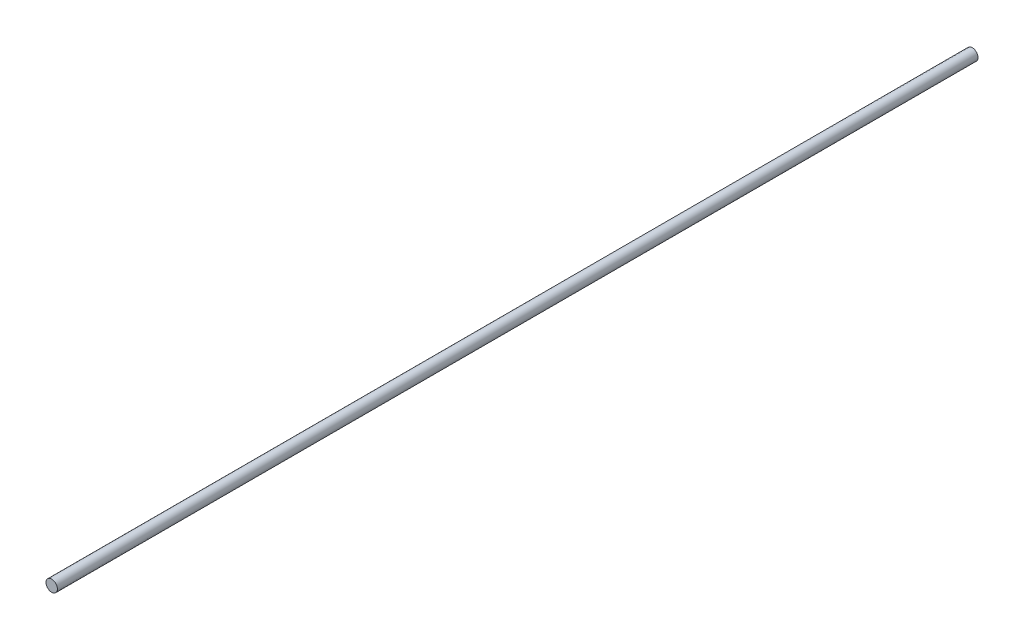
ISO-10303-21;
HEADER;
FILE_DESCRIPTION(('STEP AP214'),'2;1');
FILE_NAME('part.step','',(''),(''),'','','');
FILE_SCHEMA(('AUTOMOTIVE_DESIGN { 1 0 10303 214 1 1 1 1 }'));
ENDSEC;
DATA;
#1=APPLICATION_CONTEXT('core data for automotive mechanical design processes');
#2=APPLICATION_PROTOCOL_DEFINITION('international standard','automotive_design',2000,#1);
#3=PRODUCT_CONTEXT('',#1,'mechanical');
#4=PRODUCT('Part','Part','',(#3));
#5=PRODUCT_RELATED_PRODUCT_CATEGORY('part','',(#4));
#6=PRODUCT_DEFINITION_FORMATION('','',#4);
#7=PRODUCT_DEFINITION_CONTEXT('part definition',#1,'design');
#8=PRODUCT_DEFINITION('design','',#6,#7);
#9=PRODUCT_DEFINITION_SHAPE('','',#8);
#10=(LENGTH_UNIT() NAMED_UNIT(*) SI_UNIT(.MILLI.,.METRE.));
#11=(NAMED_UNIT(*) PLANE_ANGLE_UNIT() SI_UNIT($,.RADIAN.));
#12=(NAMED_UNIT(*) SI_UNIT($,.STERADIAN.) SOLID_ANGLE_UNIT());
#13=UNCERTAINTY_MEASURE_WITH_UNIT(LENGTH_MEASURE(1.E-05),#10,'distance_accuracy_value','');
#14=(GEOMETRIC_REPRESENTATION_CONTEXT(3) GLOBAL_UNCERTAINTY_ASSIGNED_CONTEXT((#13)) GLOBAL_UNIT_ASSIGNED_CONTEXT((#10,
#11,#12)) REPRESENTATION_CONTEXT('',''));
#15=CARTESIAN_POINT('',(0.,0.,0.));
#16=DIRECTION('',(0.,0.,1.));
#17=DIRECTION('',(1.,0.,0.));
#18=AXIS2_PLACEMENT_3D('',#15,#16,#17);
#19=CARTESIAN_POINT('',(0.,0.,645.));
#20=DIRECTION('',(0.,0.,-1.));
#21=DIRECTION('',(-1.,0.,0.));
#22=AXIS2_PLACEMENT_3D('',#19,#20,#21);
#23=CYLINDRICAL_SURFACE('',#22,4.);
#24=CARTESIAN_POINT('',(0.,0.,645.));
#25=DIRECTION('',(0.,0.,1.));
#26=DIRECTION('',(1.,0.,0.));
#27=AXIS2_PLACEMENT_3D('',#24,#25,#26);
#28=CIRCLE('',#27,4.);
#29=CARTESIAN_POINT('',(4.,0.,645.));
#30=VERTEX_POINT('',#29);
#31=EDGE_CURVE('E10',#30,#30,#28,.T.);
#32=ORIENTED_EDGE('',*,*,#31,.F.);
#33=EDGE_LOOP('',(#32));
#34=FACE_BOUND('',#33,.T.);
#35=CARTESIAN_POINT('',(0.,0.,0.));
#36=DIRECTION('',(0.,0.,1.));
#37=DIRECTION('',(1.,0.,0.));
#38=AXIS2_PLACEMENT_3D('',#35,#36,#37);
#39=CIRCLE('',#38,4.);
#40=CARTESIAN_POINT('',(4.,0.,0.));
#41=VERTEX_POINT('',#40);
#42=EDGE_CURVE('E35',#41,#41,#39,.T.);
#43=ORIENTED_EDGE('',*,*,#42,.T.);
#44=EDGE_LOOP('',(#43));
#45=FACE_BOUND('',#44,.T.);
#46=ADVANCED_FACE('F32',(#34,#45),#23,.T.);
#47=CARTESIAN_POINT('',(0.,0.,645.));
#48=DIRECTION('',(0.,0.,1.));
#49=DIRECTION('',(1.,0.,0.));
#50=AXIS2_PLACEMENT_3D('',#47,#48,#49);
#51=PLANE('',#50);
#52=ORIENTED_EDGE('',*,*,#31,.T.);
#53=EDGE_LOOP('',(#52));
#54=FACE_BOUND('',#53,.T.);
#55=ADVANCED_FACE('F47',(#54),#51,.T.);
#56=CARTESIAN_POINT('',(0.,0.,0.));
#57=DIRECTION('',(0.,0.,1.));
#58=DIRECTION('',(1.,0.,0.));
#59=AXIS2_PLACEMENT_3D('',#56,#57,#58);
#60=PLANE('',#59);
#61=ORIENTED_EDGE('',*,*,#42,.F.);
#62=EDGE_LOOP('',(#61));
#63=FACE_BOUND('',#62,.T.);
#64=ADVANCED_FACE('F45',(#63),#60,.F.);
#65=CLOSED_SHELL('',(#46,#55,#64));
#66=MANIFOLD_SOLID_BREP('B2',#65);
#67=ADVANCED_BREP_SHAPE_REPRESENTATION('',(#18,#66),#14);
#68=SHAPE_DEFINITION_REPRESENTATION(#9,#67);
ENDSEC;
END-ISO-10303-21;
